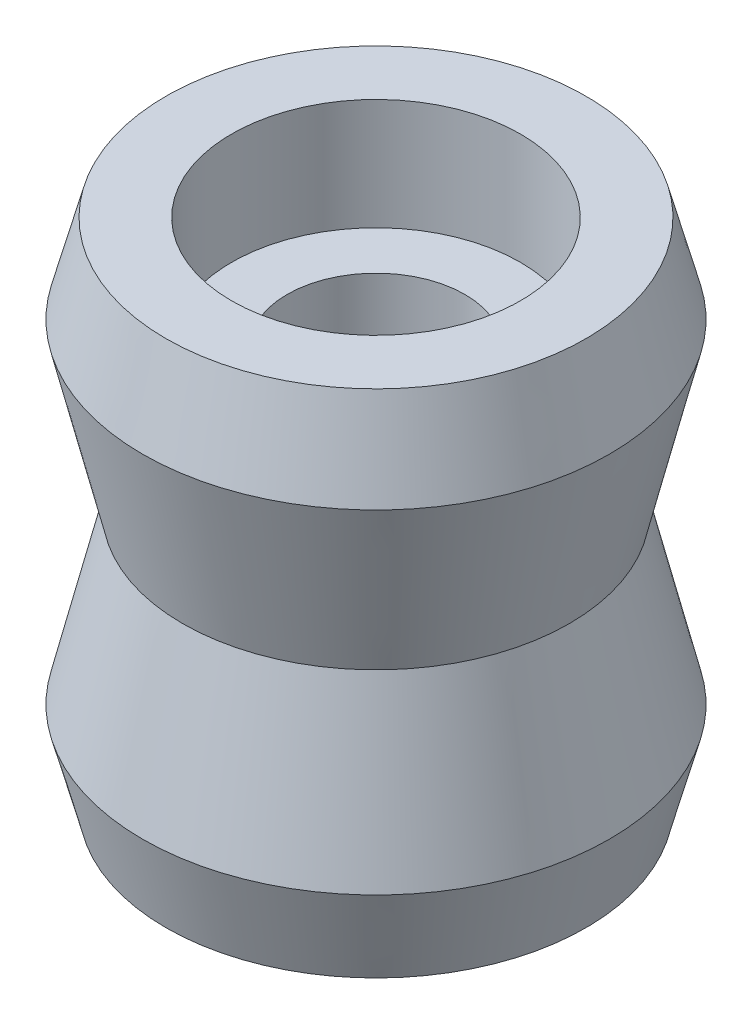
ISO-10303-21;
HEADER;
FILE_DESCRIPTION(('STEP AP214'),'2;1');
FILE_NAME('part.step','',(''),(''),'','','');
FILE_SCHEMA(('AUTOMOTIVE_DESIGN { 1 0 10303 214 1 1 1 1 }'));
ENDSEC;
DATA;
#1=APPLICATION_CONTEXT('core data for automotive mechanical design processes');
#2=APPLICATION_PROTOCOL_DEFINITION('international standard','automotive_design',2000,#1);
#3=PRODUCT_CONTEXT('',#1,'mechanical');
#4=PRODUCT('Part','Part','',(#3));
#5=PRODUCT_RELATED_PRODUCT_CATEGORY('part','',(#4));
#6=PRODUCT_DEFINITION_FORMATION('','',#4);
#7=PRODUCT_DEFINITION_CONTEXT('part definition',#1,'design');
#8=PRODUCT_DEFINITION('design','',#6,#7);
#9=PRODUCT_DEFINITION_SHAPE('','',#8);
#10=(LENGTH_UNIT() NAMED_UNIT(*) SI_UNIT(.MILLI.,.METRE.));
#11=(NAMED_UNIT(*) PLANE_ANGLE_UNIT() SI_UNIT($,.RADIAN.));
#12=(NAMED_UNIT(*) SI_UNIT($,.STERADIAN.) SOLID_ANGLE_UNIT());
#13=UNCERTAINTY_MEASURE_WITH_UNIT(LENGTH_MEASURE(1.E-05),#10,'distance_accuracy_value','');
#14=(GEOMETRIC_REPRESENTATION_CONTEXT(3) GLOBAL_UNCERTAINTY_ASSIGNED_CONTEXT((#13)) GLOBAL_UNIT_ASSIGNED_CONTEXT((#10,
#11,#12)) REPRESENTATION_CONTEXT('',''));
#15=CARTESIAN_POINT('',(0.,0.,0.));
#16=DIRECTION('',(0.,0.,1.));
#17=DIRECTION('',(1.,0.,0.));
#18=AXIS2_PLACEMENT_3D('',#15,#16,#17);
#19=CARTESIAN_POINT('',(0.,42.3234558477177,0.));
#20=DIRECTION('',(0.,1.,0.));
#21=DIRECTION('',(0.,0.,1.));
#22=AXIS2_PLACEMENT_3D('',#19,#20,#21);
#23=CYLINDRICAL_SURFACE('',#22,4.);
#24=CARTESIAN_POINT('',(0.,9.66900053684746,0.));
#25=DIRECTION('',(0.,1.,0.));
#26=DIRECTION('',(0.,0.,1.));
#27=AXIS2_PLACEMENT_3D('',#24,#25,#26);
#28=CIRCLE('',#27,4.);
#29=CARTESIAN_POINT('',(0.,9.66900053684746,4.));
#30=VERTEX_POINT('',#29);
#31=EDGE_CURVE('E61',#30,#30,#28,.T.);
#32=ORIENTED_EDGE('',*,*,#31,.T.);
#33=EDGE_LOOP('',(#32));
#34=FACE_BOUND('',#33,.T.);
#35=CARTESIAN_POINT('',(0.,-3.08436697366508,0.));
#36=DIRECTION('',(0.,-1.,0.));
#37=DIRECTION('',(0.,0.,-1.));
#38=AXIS2_PLACEMENT_3D('',#35,#36,#37);
#39=CIRCLE('',#38,4.);
#40=CARTESIAN_POINT('',(0.,-3.08436697366508,-4.));
#41=VERTEX_POINT('',#40);
#42=EDGE_CURVE('E10',#41,#41,#39,.F.);
#43=ORIENTED_EDGE('',*,*,#42,.F.);
#44=EDGE_LOOP('',(#43));
#45=FACE_BOUND('',#44,.T.);
#46=ADVANCED_FACE('F37',(#34,#45),#23,.F.);
#47=CARTESIAN_POINT('',(0.,-8.28436697366508,0.));
#48=DIRECTION('',(0.,1.,0.));
#49=DIRECTION('',(0.,0.,1.));
#50=AXIS2_PLACEMENT_3D('',#47,#48,#49);
#51=CONICAL_SURFACE('',#50,9.44834512402877,0.258536651886108);
#52=CARTESIAN_POINT('',(0.,-4.30768321840881,0.));
#53=DIRECTION('',(0.,1.,0.));
#54=DIRECTION('',(0.,0.,1.));
#55=AXIS2_PLACEMENT_3D('',#52,#53,#54);
#56=CIRCLE('',#55,10.5);
#57=CARTESIAN_POINT('',(0.,-4.30768321840881,10.5));
#58=VERTEX_POINT('',#57);
#59=EDGE_CURVE('E85',#58,#58,#56,.T.);
#60=ORIENTED_EDGE('',*,*,#59,.F.);
#61=EDGE_LOOP('',(#60));
#62=FACE_BOUND('',#61,.T.);
#63=CARTESIAN_POINT('',(0.,-8.28436697366508,0.));
#64=DIRECTION('',(0.,1.,0.));
#65=DIRECTION('',(0.,0.,1.));
#66=AXIS2_PLACEMENT_3D('',#63,#64,#65);
#67=CIRCLE('',#66,9.44834512402877);
#68=CARTESIAN_POINT('',(0.,-8.28436697366508,9.44834512402877));
#69=VERTEX_POINT('',#68);
#70=EDGE_CURVE('E45',#69,#69,#67,.T.);
#71=ORIENTED_EDGE('',*,*,#70,.T.);
#72=EDGE_LOOP('',(#71));
#73=FACE_BOUND('',#72,.T.);
#74=ADVANCED_FACE('F39',(#62,#73),#51,.T.);
#75=CARTESIAN_POINT('',(6.5,-8.28436697366508,0.));
#76=DIRECTION('',(0.,1.,0.));
#77=DIRECTION('',(0.,0.,1.));
#78=AXIS2_PLACEMENT_3D('',#75,#76,#77);
#79=PLANE('',#78);
#80=ORIENTED_EDGE('',*,*,#70,.F.);
#81=EDGE_LOOP('',(#80));
#82=FACE_BOUND('',#81,.T.);
#83=CARTESIAN_POINT('',(0.,-8.28436697366508,0.));
#84=DIRECTION('',(0.,1.,0.));
#85=DIRECTION('',(0.,0.,1.));
#86=AXIS2_PLACEMENT_3D('',#83,#84,#85);
#87=CIRCLE('',#86,6.5);
#88=CARTESIAN_POINT('',(0.,-8.28436697366508,6.5));
#89=VERTEX_POINT('',#88);
#90=EDGE_CURVE('E50',#89,#89,#87,.T.);
#91=ORIENTED_EDGE('',*,*,#90,.T.);
#92=EDGE_LOOP('',(#91));
#93=FACE_BOUND('',#92,.T.);
#94=ADVANCED_FACE('F93',(#82,#93),#79,.F.);
#95=CARTESIAN_POINT('',(0.,42.3234558477177,0.));
#96=DIRECTION('',(0.,1.,0.));
#97=DIRECTION('',(0.,0.,1.));
#98=AXIS2_PLACEMENT_3D('',#95,#96,#97);
#99=CYLINDRICAL_SURFACE('',#98,6.5);
#100=ORIENTED_EDGE('',*,*,#90,.F.);
#101=EDGE_LOOP('',(#100));
#102=FACE_BOUND('',#101,.T.);
#103=CARTESIAN_POINT('',(0.,-3.28436697366508,0.));
#104=DIRECTION('',(0.,1.,0.));
#105=DIRECTION('',(0.,0.,1.));
#106=AXIS2_PLACEMENT_3D('',#103,#104,#105);
#107=CIRCLE('',#106,6.5);
#108=CARTESIAN_POINT('',(0.,-3.28436697366508,6.5));
#109=VERTEX_POINT('',#108);
#110=EDGE_CURVE('E55',#109,#109,#107,.T.);
#111=ORIENTED_EDGE('',*,*,#110,.T.);
#112=EDGE_LOOP('',(#111));
#113=FACE_BOUND('',#112,.T.);
#114=ADVANCED_FACE('F98',(#102,#113),#99,.F.);
#115=CARTESIAN_POINT('',(4.,-3.28436697366508,0.));
#116=DIRECTION('',(0.,1.,0.));
#117=DIRECTION('',(0.,0.,1.));
#118=AXIS2_PLACEMENT_3D('',#115,#116,#117);
#119=PLANE('',#118);
#120=ORIENTED_EDGE('',*,*,#110,.F.);
#121=EDGE_LOOP('',(#120));
#122=FACE_BOUND('',#121,.T.);
#123=ADVANCED_FACE('F109',(#122),#119,.F.);
#124=CARTESIAN_POINT('',(4.,9.66900053684746,0.));
#125=DIRECTION('',(0.,-1.,0.));
#126=DIRECTION('',(0.,0.,-1.));
#127=AXIS2_PLACEMENT_3D('',#124,#125,#126);
#128=PLANE('',#127);
#129=ORIENTED_EDGE('',*,*,#31,.F.);
#130=EDGE_LOOP('',(#129));
#131=FACE_BOUND('',#130,.T.);
#132=CARTESIAN_POINT('',(0.,9.66900053684746,0.));
#133=DIRECTION('',(0.,1.,0.));
#134=DIRECTION('',(0.,0.,1.));
#135=AXIS2_PLACEMENT_3D('',#132,#133,#134);
#136=CIRCLE('',#135,6.5);
#137=CARTESIAN_POINT('',(0.,9.66900053684746,6.5));
#138=VERTEX_POINT('',#137);
#139=EDGE_CURVE('E65',#138,#138,#136,.T.);
#140=ORIENTED_EDGE('',*,*,#139,.T.);
#141=EDGE_LOOP('',(#140));
#142=FACE_BOUND('',#141,.T.);
#143=ADVANCED_FACE('F107',(#131,#142),#128,.F.);
#144=CARTESIAN_POINT('',(0.,42.3234558477177,0.));
#145=DIRECTION('',(0.,1.,0.));
#146=DIRECTION('',(0.,0.,1.));
#147=AXIS2_PLACEMENT_3D('',#144,#145,#146);
#148=CYLINDRICAL_SURFACE('',#147,6.5);
#149=ORIENTED_EDGE('',*,*,#139,.F.);
#150=EDGE_LOOP('',(#149));
#151=FACE_BOUND('',#150,.T.);
#152=CARTESIAN_POINT('',(0.,14.6690005368475,0.));
#153=DIRECTION('',(0.,1.,0.));
#154=DIRECTION('',(0.,0.,1.));
#155=AXIS2_PLACEMENT_3D('',#152,#153,#154);
#156=CIRCLE('',#155,6.5);
#157=CARTESIAN_POINT('',(0.,14.6690005368475,6.5));
#158=VERTEX_POINT('',#157);
#159=EDGE_CURVE('E69',#158,#158,#156,.T.);
#160=ORIENTED_EDGE('',*,*,#159,.T.);
#161=EDGE_LOOP('',(#160));
#162=FACE_BOUND('',#161,.T.);
#163=ADVANCED_FACE('F134',(#151,#162),#148,.F.);
#164=CARTESIAN_POINT('',(6.5,14.6690005368475,0.));
#165=DIRECTION('',(0.,-1.,0.));
#166=DIRECTION('',(0.,0.,-1.));
#167=AXIS2_PLACEMENT_3D('',#164,#165,#166);
#168=PLANE('',#167);
#169=ORIENTED_EDGE('',*,*,#159,.F.);
#170=EDGE_LOOP('',(#169));
#171=FACE_BOUND('',#170,.T.);
#172=CARTESIAN_POINT('',(0.,14.6690005368475,0.));
#173=DIRECTION('',(0.,1.,0.));
#174=DIRECTION('',(0.,0.,1.));
#175=AXIS2_PLACEMENT_3D('',#172,#173,#174);
#176=CIRCLE('',#175,9.44834512402877);
#177=CARTESIAN_POINT('',(0.,14.6690005368475,9.44834512402877));
#178=VERTEX_POINT('',#177);
#179=EDGE_CURVE('E73',#178,#178,#176,.T.);
#180=ORIENTED_EDGE('',*,*,#179,.T.);
#181=EDGE_LOOP('',(#180));
#182=FACE_BOUND('',#181,.T.);
#183=ADVANCED_FACE('F141',(#171,#182),#168,.F.);
#184=CARTESIAN_POINT('',(0.,10.6923167815912,0.));
#185=DIRECTION('',(0.,-1.,0.));
#186=DIRECTION('',(0.,0.,-1.));
#187=AXIS2_PLACEMENT_3D('',#184,#185,#186);
#188=CONICAL_SURFACE('',#187,10.5,0.258536651886108);
#189=ORIENTED_EDGE('',*,*,#179,.F.);
#190=EDGE_LOOP('',(#189));
#191=FACE_BOUND('',#190,.T.);
#192=CARTESIAN_POINT('',(0.,10.6923167815912,0.));
#193=DIRECTION('',(0.,1.,0.));
#194=DIRECTION('',(0.,0.,1.));
#195=AXIS2_PLACEMENT_3D('',#192,#193,#194);
#196=CIRCLE('',#195,10.5);
#197=CARTESIAN_POINT('',(0.,10.6923167815912,10.5));
#198=VERTEX_POINT('',#197);
#199=EDGE_CURVE('E77',#198,#198,#196,.T.);
#200=ORIENTED_EDGE('',*,*,#199,.T.);
#201=EDGE_LOOP('',(#200));
#202=FACE_BOUND('',#201,.T.);
#203=ADVANCED_FACE('F148',(#191,#202),#188,.T.);
#204=CARTESIAN_POINT('',(0.,3.19231678159119,0.));
#205=DIRECTION('',(0.,1.,0.));
#206=DIRECTION('',(0.,0.,1.));
#207=AXIS2_PLACEMENT_3D('',#204,#205,#206);
#208=CONICAL_SURFACE('',#207,8.7,0.235544980720863);
#209=ORIENTED_EDGE('',*,*,#199,.F.);
#210=EDGE_LOOP('',(#209));
#211=FACE_BOUND('',#210,.T.);
#212=CARTESIAN_POINT('',(0.,3.19231678159119,0.));
#213=DIRECTION('',(0.,1.,0.));
#214=DIRECTION('',(0.,0.,1.));
#215=AXIS2_PLACEMENT_3D('',#212,#213,#214);
#216=CIRCLE('',#215,8.7);
#217=CARTESIAN_POINT('',(0.,3.19231678159119,8.7));
#218=VERTEX_POINT('',#217);
#219=EDGE_CURVE('E81',#218,#218,#216,.T.);
#220=ORIENTED_EDGE('',*,*,#219,.T.);
#221=EDGE_LOOP('',(#220));
#222=FACE_BOUND('',#221,.T.);
#223=ADVANCED_FACE('F156',(#211,#222),#208,.T.);
#224=CARTESIAN_POINT('',(0.,-4.30768321840881,0.));
#225=DIRECTION('',(0.,-1.,0.));
#226=DIRECTION('',(0.,0.,-1.));
#227=AXIS2_PLACEMENT_3D('',#224,#225,#226);
#228=CONICAL_SURFACE('',#227,10.5,0.235544980720863);
#229=ORIENTED_EDGE('',*,*,#219,.F.);
#230=EDGE_LOOP('',(#229));
#231=FACE_BOUND('',#230,.T.);
#232=ORIENTED_EDGE('',*,*,#59,.T.);
#233=EDGE_LOOP('',(#232));
#234=FACE_BOUND('',#233,.T.);
#235=ADVANCED_FACE('F90',(#231,#234),#228,.T.);
#236=CARTESIAN_POINT('',(0.,-3.08436697366508,0.));
#237=DIRECTION('',(0.,-1.,0.));
#238=DIRECTION('',(0.,0.,-1.));
#239=AXIS2_PLACEMENT_3D('',#236,#237,#238);
#240=PLANE('',#239);
#241=ORIENTED_EDGE('',*,*,#42,.T.);
#242=EDGE_LOOP('',(#241));
#243=FACE_BOUND('',#242,.T.);
#244=ADVANCED_FACE('F171',(#243),#240,.F.);
#245=CLOSED_SHELL('',(#46,#74,#94,#114,#123,#143,#163,#183,#203,#223,#235,#244));
#246=MANIFOLD_SOLID_BREP('B2',#245);
#247=ADVANCED_BREP_SHAPE_REPRESENTATION('',(#18,#246),#14);
#248=SHAPE_DEFINITION_REPRESENTATION(#9,#247);
ENDSEC;
END-ISO-10303-21;
